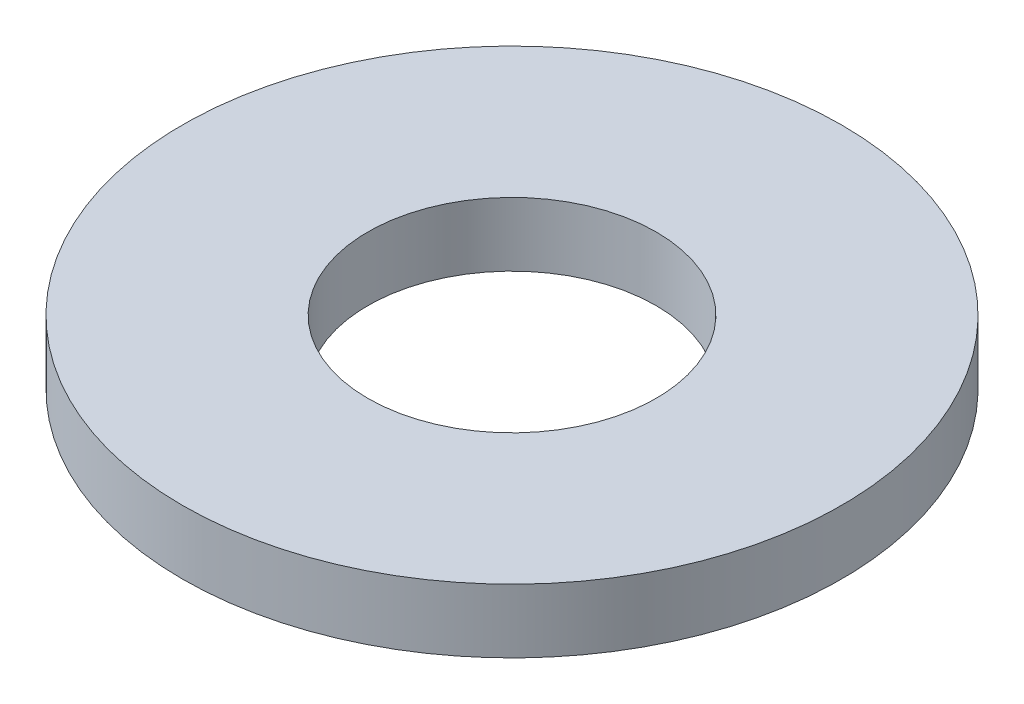
ISO-10303-21;
HEADER;
FILE_DESCRIPTION(('STEP AP214'),'2;1');
FILE_NAME('part.step','',(''),(''),'','','');
FILE_SCHEMA(('AUTOMOTIVE_DESIGN { 1 0 10303 214 1 1 1 1 }'));
ENDSEC;
DATA;
#1=APPLICATION_CONTEXT('core data for automotive mechanical design processes');
#2=APPLICATION_PROTOCOL_DEFINITION('international standard','automotive_design',2000,#1);
#3=PRODUCT_CONTEXT('',#1,'mechanical');
#4=PRODUCT('Part','Part','',(#3));
#5=PRODUCT_RELATED_PRODUCT_CATEGORY('part','',(#4));
#6=PRODUCT_DEFINITION_FORMATION('','',#4);
#7=PRODUCT_DEFINITION_CONTEXT('part definition',#1,'design');
#8=PRODUCT_DEFINITION('design','',#6,#7);
#9=PRODUCT_DEFINITION_SHAPE('','',#8);
#10=(LENGTH_UNIT() NAMED_UNIT(*) SI_UNIT(.MILLI.,.METRE.));
#11=(NAMED_UNIT(*) PLANE_ANGLE_UNIT() SI_UNIT($,.RADIAN.));
#12=(NAMED_UNIT(*) SI_UNIT($,.STERADIAN.) SOLID_ANGLE_UNIT());
#13=UNCERTAINTY_MEASURE_WITH_UNIT(LENGTH_MEASURE(1.E-05),#10,'distance_accuracy_value','');
#14=(GEOMETRIC_REPRESENTATION_CONTEXT(3) GLOBAL_UNCERTAINTY_ASSIGNED_CONTEXT((#13)) GLOBAL_UNIT_ASSIGNED_CONTEXT((#10,
#11,#12)) REPRESENTATION_CONTEXT('',''));
#15=CARTESIAN_POINT('',(0.,0.,0.));
#16=DIRECTION('',(0.,0.,1.));
#17=DIRECTION('',(1.,0.,0.));
#18=AXIS2_PLACEMENT_3D('',#15,#16,#17);
#19=CARTESIAN_POINT('',(8.128,0.,0.));
#20=DIRECTION('',(0.,1.,0.));
#21=DIRECTION('',(0.,0.,1.));
#22=AXIS2_PLACEMENT_3D('',#19,#20,#21);
#23=PLANE('',#22);
#24=CARTESIAN_POINT('',(0.,0.,0.));
#25=DIRECTION('',(0.,-1.,0.));
#26=DIRECTION('',(0.,0.,-1.));
#27=AXIS2_PLACEMENT_3D('',#24,#25,#26);
#28=CIRCLE('',#27,3.556);
#29=CARTESIAN_POINT('',(0.,0.,-3.556));
#30=VERTEX_POINT('',#29);
#31=EDGE_CURVE('E10',#30,#30,#28,.T.);
#32=ORIENTED_EDGE('',*,*,#31,.T.);
#33=EDGE_LOOP('',(#32));
#34=FACE_BOUND('',#33,.T.);
#35=CARTESIAN_POINT('',(0.,0.,0.));
#36=DIRECTION('',(0.,-1.,0.));
#37=DIRECTION('',(0.,0.,-1.));
#38=AXIS2_PLACEMENT_3D('',#35,#36,#37);
#39=CIRCLE('',#38,8.128);
#40=CARTESIAN_POINT('',(0.,0.,-8.128));
#41=VERTEX_POINT('',#40);
#42=EDGE_CURVE('E46',#41,#41,#39,.T.);
#43=ORIENTED_EDGE('',*,*,#42,.F.);
#44=EDGE_LOOP('',(#43));
#45=FACE_BOUND('',#44,.T.);
#46=ADVANCED_FACE('F32',(#34,#45),#23,.T.);
#47=CARTESIAN_POINT('',(0.,0.,0.));
#48=DIRECTION('',(0.,-1.,0.));
#49=DIRECTION('',(0.,0.,-1.));
#50=AXIS2_PLACEMENT_3D('',#47,#48,#49);
#51=CYLINDRICAL_SURFACE('',#50,3.556);
#52=CARTESIAN_POINT('',(0.,-1.5748,0.));
#53=DIRECTION('',(0.,-1.,0.));
#54=DIRECTION('',(0.,0.,-1.));
#55=AXIS2_PLACEMENT_3D('',#52,#53,#54);
#56=CIRCLE('',#55,3.556);
#57=CARTESIAN_POINT('',(0.,-1.5748,-3.556));
#58=VERTEX_POINT('',#57);
#59=EDGE_CURVE('E38',#58,#58,#56,.T.);
#60=ORIENTED_EDGE('',*,*,#59,.T.);
#61=EDGE_LOOP('',(#60));
#62=FACE_BOUND('',#61,.T.);
#63=ORIENTED_EDGE('',*,*,#31,.F.);
#64=EDGE_LOOP('',(#63));
#65=FACE_BOUND('',#64,.T.);
#66=ADVANCED_FACE('F56',(#62,#65),#51,.F.);
#67=CARTESIAN_POINT('',(3.556,-1.5748,0.));
#68=DIRECTION('',(0.,-1.,0.));
#69=DIRECTION('',(0.,0.,-1.));
#70=AXIS2_PLACEMENT_3D('',#67,#68,#69);
#71=PLANE('',#70);
#72=CARTESIAN_POINT('',(0.,-1.5748,0.));
#73=DIRECTION('',(0.,-1.,0.));
#74=DIRECTION('',(0.,0.,-1.));
#75=AXIS2_PLACEMENT_3D('',#72,#73,#74);
#76=CIRCLE('',#75,8.128);
#77=CARTESIAN_POINT('',(0.,-1.5748,-8.128));
#78=VERTEX_POINT('',#77);
#79=EDGE_CURVE('E42',#78,#78,#76,.T.);
#80=ORIENTED_EDGE('',*,*,#79,.T.);
#81=EDGE_LOOP('',(#80));
#82=FACE_BOUND('',#81,.T.);
#83=ORIENTED_EDGE('',*,*,#59,.F.);
#84=EDGE_LOOP('',(#83));
#85=FACE_BOUND('',#84,.T.);
#86=ADVANCED_FACE('F60',(#82,#85),#71,.T.);
#87=CARTESIAN_POINT('',(0.,0.,0.));
#88=DIRECTION('',(0.,-1.,0.));
#89=DIRECTION('',(0.,0.,-1.));
#90=AXIS2_PLACEMENT_3D('',#87,#88,#89);
#91=CYLINDRICAL_SURFACE('',#90,8.128);
#92=ORIENTED_EDGE('',*,*,#42,.T.);
#93=EDGE_LOOP('',(#92));
#94=FACE_BOUND('',#93,.T.);
#95=ORIENTED_EDGE('',*,*,#79,.F.);
#96=EDGE_LOOP('',(#95));
#97=FACE_BOUND('',#96,.T.);
#98=ADVANCED_FACE('F52',(#94,#97),#91,.T.);
#99=CLOSED_SHELL('',(#46,#66,#86,#98));
#100=MANIFOLD_SOLID_BREP('B2',#99);
#101=ADVANCED_BREP_SHAPE_REPRESENTATION('',(#18,#100),#14);
#102=SHAPE_DEFINITION_REPRESENTATION(#9,#101);
ENDSEC;
END-ISO-10303-21;
